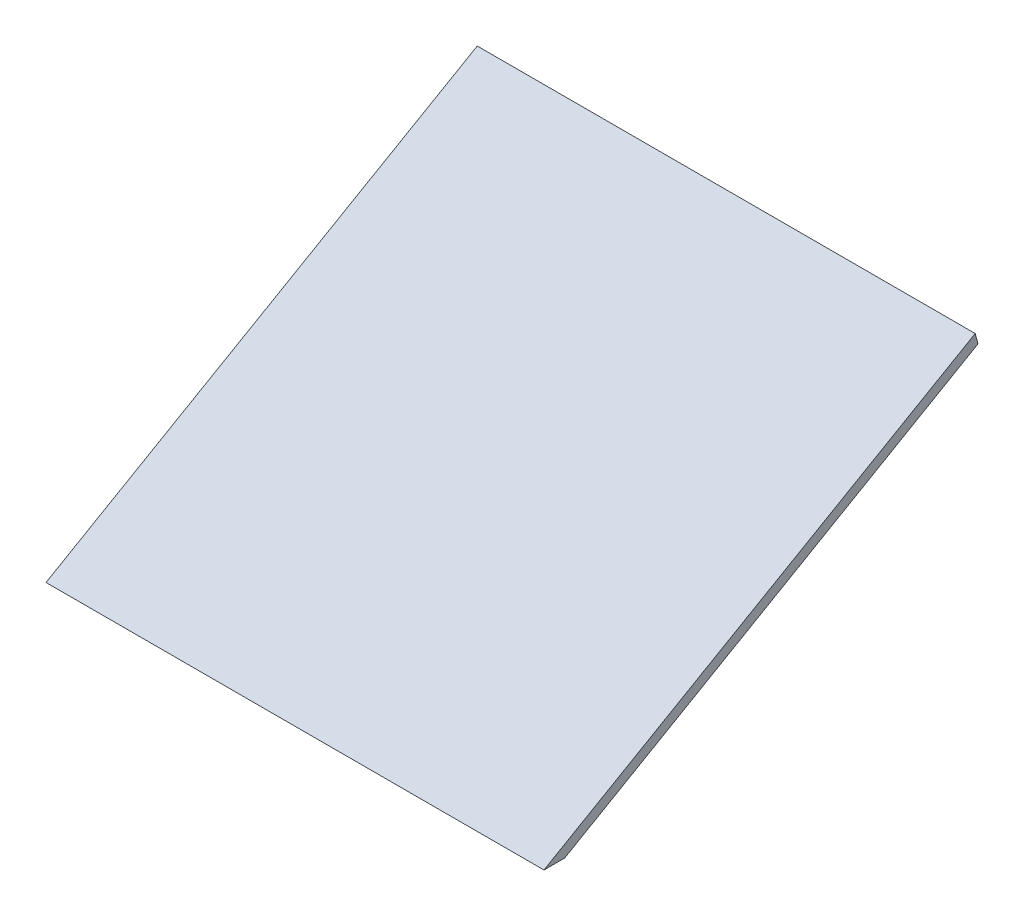
ISO-10303-21;
HEADER;
FILE_DESCRIPTION(('STEP AP214'),'2;1');
FILE_NAME('part.step','',(''),(''),'','','');
FILE_SCHEMA(('AUTOMOTIVE_DESIGN { 1 0 10303 214 1 1 1 1 }'));
ENDSEC;
DATA;
#1=APPLICATION_CONTEXT('core data for automotive mechanical design processes');
#2=APPLICATION_PROTOCOL_DEFINITION('international standard','automotive_design',2000,#1);
#3=PRODUCT_CONTEXT('',#1,'mechanical');
#4=PRODUCT('Part','Part','',(#3));
#5=PRODUCT_RELATED_PRODUCT_CATEGORY('part','',(#4));
#6=PRODUCT_DEFINITION_FORMATION('','',#4);
#7=PRODUCT_DEFINITION_CONTEXT('part definition',#1,'design');
#8=PRODUCT_DEFINITION('design','',#6,#7);
#9=PRODUCT_DEFINITION_SHAPE('','',#8);
#10=(LENGTH_UNIT() NAMED_UNIT(*) SI_UNIT(.MILLI.,.METRE.));
#11=(NAMED_UNIT(*) PLANE_ANGLE_UNIT() SI_UNIT($,.RADIAN.));
#12=(NAMED_UNIT(*) SI_UNIT($,.STERADIAN.) SOLID_ANGLE_UNIT());
#13=UNCERTAINTY_MEASURE_WITH_UNIT(LENGTH_MEASURE(1.E-05),#10,'distance_accuracy_value','');
#14=(GEOMETRIC_REPRESENTATION_CONTEXT(3) GLOBAL_UNCERTAINTY_ASSIGNED_CONTEXT((#13)) GLOBAL_UNIT_ASSIGNED_CONTEXT((#10,
#11,#12)) REPRESENTATION_CONTEXT('',''));
#15=CARTESIAN_POINT('',(0.,0.,0.));
#16=DIRECTION('',(0.,0.,1.));
#17=DIRECTION('',(1.,0.,0.));
#18=AXIS2_PLACEMENT_3D('',#15,#16,#17);
#19=CARTESIAN_POINT('',(609.6,304.8,-527.929086147001));
#20=DIRECTION('',(0.,-0.866025403784442,-0.499999999999995));
#21=DIRECTION('',(0.,0.499999999999995,-0.866025403784442));
#22=AXIS2_PLACEMENT_3D('',#19,#20,#21);
#23=PLANE('',#22);
#24=DIRECTION('',(0.,-0.499999999999995,0.866025403784441));
#25=VECTOR('',#24,1.);
#26=CARTESIAN_POINT('',(0.,304.8,-527.929086147001));
#27=LINE('',#26,#25);
#28=CARTESIAN_POINT('',(0.,304.8,-527.929086147001));
#29=VERTEX_POINT('',#28);
#30=CARTESIAN_POINT('',(0.,0.,0.));
#31=VERTEX_POINT('',#30);
#32=EDGE_CURVE('E96',#29,#31,#27,.T.);
#33=ORIENTED_EDGE('',*,*,#32,.T.);
#34=DIRECTION('',(-1.,0.,0.));
#35=VECTOR('',#34,1.);
#36=CARTESIAN_POINT('',(609.6,0.,0.));
#37=LINE('',#36,#35);
#38=CARTESIAN_POINT('',(609.6,0.,0.));
#39=VERTEX_POINT('',#38);
#40=EDGE_CURVE('E11',#39,#31,#37,.T.);
#41=ORIENTED_EDGE('',*,*,#40,.F.);
#42=DIRECTION('',(0.,-0.499999999999995,0.866025403784441));
#43=VECTOR('',#42,1.);
#44=CARTESIAN_POINT('',(609.6,304.8,-527.929086147001));
#45=LINE('',#44,#43);
#46=CARTESIAN_POINT('',(609.6,304.8,-527.929086147001));
#47=VERTEX_POINT('',#46);
#48=EDGE_CURVE('E84',#47,#39,#45,.T.);
#49=ORIENTED_EDGE('',*,*,#48,.F.);
#50=DIRECTION('',(-1.,0.,0.));
#51=VECTOR('',#50,1.);
#52=CARTESIAN_POINT('',(609.6,304.8,-527.929086147001));
#53=LINE('',#52,#51);
#54=EDGE_CURVE('E92',#47,#29,#53,.T.);
#55=ORIENTED_EDGE('',*,*,#54,.T.);
#56=EDGE_LOOP('',(#33,#41,#49,#55));
#57=FACE_BOUND('',#56,.T.);
#58=ADVANCED_FACE('F33',(#57),#23,.F.);
#59=CARTESIAN_POINT('',(609.6,0.,0.));
#60=DIRECTION('',(0.,1.,0.));
#61=DIRECTION('',(0.,0.,1.));
#62=AXIS2_PLACEMENT_3D('',#59,#60,#61);
#63=PLANE('',#62);
#64=DIRECTION('',(0.,0.,-1.));
#65=VECTOR('',#64,1.);
#66=CARTESIAN_POINT('',(0.,0.,0.));
#67=LINE('',#66,#65);
#68=CARTESIAN_POINT('',(0.,0.,-25.4000000000003));
#69=VERTEX_POINT('',#68);
#70=EDGE_CURVE('E88',#31,#69,#67,.T.);
#71=ORIENTED_EDGE('',*,*,#70,.T.);
#72=DIRECTION('',(-1.,0.,0.));
#73=VECTOR('',#72,1.);
#74=CARTESIAN_POINT('',(609.6,0.,-25.4000000000003));
#75=LINE('',#74,#73);
#76=CARTESIAN_POINT('',(609.6,0.,-25.4000000000003));
#77=VERTEX_POINT('',#76);
#78=EDGE_CURVE('E41',#77,#69,#75,.T.);
#79=ORIENTED_EDGE('',*,*,#78,.F.);
#80=DIRECTION('',(0.,0.,-1.));
#81=VECTOR('',#80,1.);
#82=CARTESIAN_POINT('',(609.6,0.,0.));
#83=LINE('',#82,#81);
#84=EDGE_CURVE('E79',#39,#77,#83,.T.);
#85=ORIENTED_EDGE('',*,*,#84,.F.);
#86=ORIENTED_EDGE('',*,*,#40,.T.);
#87=EDGE_LOOP('',(#71,#79,#85,#86));
#88=FACE_BOUND('',#87,.T.);
#89=ADVANCED_FACE('F87',(#88),#63,.F.);
#90=CARTESIAN_POINT('',(609.6,0.,-25.4000000000003));
#91=DIRECTION('',(0.,0.866025403784442,0.499999999999995));
#92=DIRECTION('',(0.,-0.499999999999995,0.866025403784442));
#93=AXIS2_PLACEMENT_3D('',#90,#91,#92);
#94=PLANE('',#93);
#95=DIRECTION('',(0.,0.499999999999995,-0.866025403784441));
#96=VECTOR('',#95,1.);
#97=CARTESIAN_POINT('',(0.,0.,-25.4000000000003));
#98=LINE('',#97,#96);
#99=CARTESIAN_POINT('',(0.,292.1,-531.332040890876));
#100=VERTEX_POINT('',#99);
#101=EDGE_CURVE('E66',#69,#100,#98,.T.);
#102=ORIENTED_EDGE('',*,*,#101,.T.);
#103=DIRECTION('',(-1.,0.,0.));
#104=VECTOR('',#103,1.);
#105=CARTESIAN_POINT('',(609.6,292.1,-531.332040890876));
#106=LINE('',#105,#104);
#107=CARTESIAN_POINT('',(609.6,292.1,-531.332040890876));
#108=VERTEX_POINT('',#107);
#109=EDGE_CURVE('E89',#108,#100,#106,.T.);
#110=ORIENTED_EDGE('',*,*,#109,.F.);
#111=DIRECTION('',(0.,0.499999999999995,-0.866025403784441));
#112=VECTOR('',#111,1.);
#113=CARTESIAN_POINT('',(609.6,0.,-25.4000000000003));
#114=LINE('',#113,#112);
#115=EDGE_CURVE('E82',#77,#108,#114,.T.);
#116=ORIENTED_EDGE('',*,*,#115,.F.);
#117=ORIENTED_EDGE('',*,*,#78,.T.);
#118=EDGE_LOOP('',(#102,#110,#116,#117));
#119=FACE_BOUND('',#118,.T.);
#120=ADVANCED_FACE('F90',(#119),#94,.F.);
#121=CARTESIAN_POINT('',(609.6,292.1,-531.332040890876));
#122=DIRECTION('',(0.,-0.258819045102517,0.965925826289069));
#123=DIRECTION('',(0.,-0.965925826289069,-0.258819045102517));
#124=AXIS2_PLACEMENT_3D('',#121,#122,#123);
#125=PLANE('',#124);
#126=DIRECTION('',(0.,0.965925826289069,0.258819045102517));
#127=VECTOR('',#126,1.);
#128=CARTESIAN_POINT('',(0.,292.1,-531.332040890876));
#129=LINE('',#128,#127);
#130=EDGE_CURVE('E72',#100,#29,#129,.T.);
#131=ORIENTED_EDGE('',*,*,#130,.T.);
#132=ORIENTED_EDGE('',*,*,#54,.F.);
#133=DIRECTION('',(0.,0.965925826289069,0.258819045102517));
#134=VECTOR('',#133,1.);
#135=CARTESIAN_POINT('',(609.6,292.1,-531.332040890876));
#136=LINE('',#135,#134);
#137=EDGE_CURVE('E49',#108,#47,#136,.T.);
#138=ORIENTED_EDGE('',*,*,#137,.F.);
#139=ORIENTED_EDGE('',*,*,#109,.T.);
#140=EDGE_LOOP('',(#131,#132,#138,#139));
#141=FACE_BOUND('',#140,.T.);
#142=ADVANCED_FACE('F103',(#141),#125,.F.);
#143=CARTESIAN_POINT('',(609.6,0.,0.));
#144=DIRECTION('',(-1.,0.,0.));
#145=DIRECTION('',(0.,0.,1.));
#146=AXIS2_PLACEMENT_3D('',#143,#144,#145);
#147=PLANE('',#146);
#148=ORIENTED_EDGE('',*,*,#48,.T.);
#149=ORIENTED_EDGE('',*,*,#84,.T.);
#150=ORIENTED_EDGE('',*,*,#115,.T.);
#151=ORIENTED_EDGE('',*,*,#137,.T.);
#152=EDGE_LOOP('',(#148,#149,#150,#151));
#153=FACE_BOUND('',#152,.T.);
#154=ADVANCED_FACE('F80',(#153),#147,.F.);
#155=CARTESIAN_POINT('',(0.,0.,0.));
#156=DIRECTION('',(-1.,0.,0.));
#157=DIRECTION('',(0.,0.,1.));
#158=AXIS2_PLACEMENT_3D('',#155,#156,#157);
#159=PLANE('',#158);
#160=ORIENTED_EDGE('',*,*,#32,.F.);
#161=ORIENTED_EDGE('',*,*,#130,.F.);
#162=ORIENTED_EDGE('',*,*,#101,.F.);
#163=ORIENTED_EDGE('',*,*,#70,.F.);
#164=EDGE_LOOP('',(#160,#161,#162,#163));
#165=FACE_BOUND('',#164,.T.);
#166=ADVANCED_FACE('F106',(#165),#159,.T.);
#167=CLOSED_SHELL('',(#58,#89,#120,#142,#154,#166));
#168=MANIFOLD_SOLID_BREP('B2',#167);
#169=ADVANCED_BREP_SHAPE_REPRESENTATION('',(#18,#168),#14);
#170=SHAPE_DEFINITION_REPRESENTATION(#9,#169);
ENDSEC;
END-ISO-10303-21;
